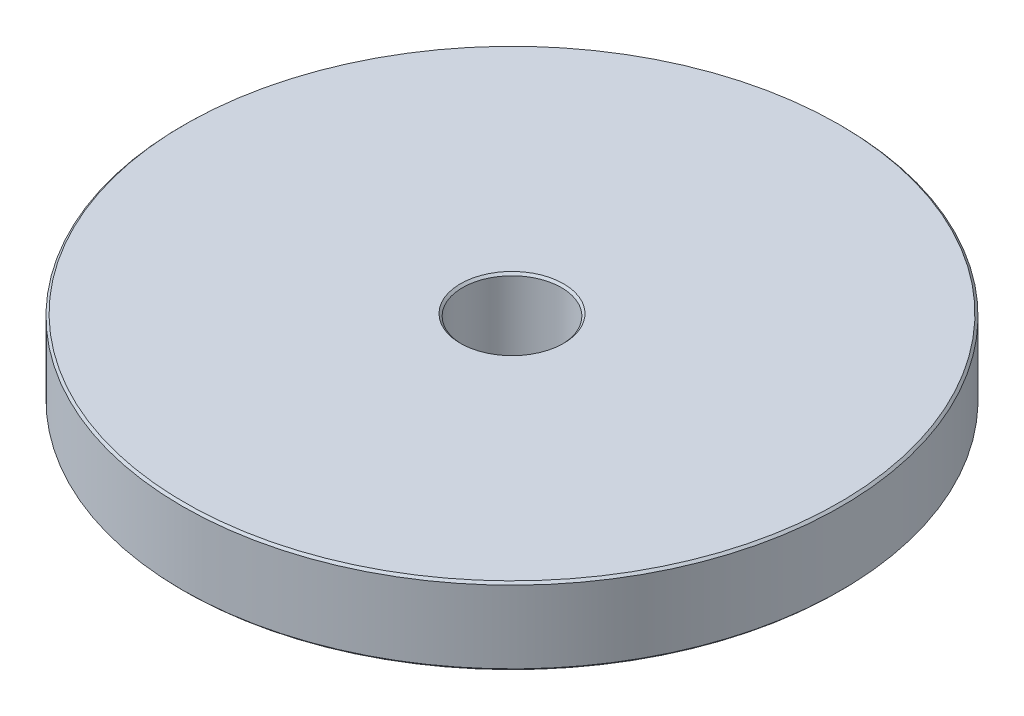
ISO-10303-21;
HEADER;
FILE_DESCRIPTION(('STEP AP214'),'2;1');
FILE_NAME('part.step','',(''),(''),'','','');
FILE_SCHEMA(('AUTOMOTIVE_DESIGN { 1 0 10303 214 1 1 1 1 }'));
ENDSEC;
DATA;
#1=APPLICATION_CONTEXT('core data for automotive mechanical design processes');
#2=APPLICATION_PROTOCOL_DEFINITION('international standard','automotive_design',2000,#1);
#3=PRODUCT_CONTEXT('',#1,'mechanical');
#4=PRODUCT('Part','Part','',(#3));
#5=PRODUCT_RELATED_PRODUCT_CATEGORY('part','',(#4));
#6=PRODUCT_DEFINITION_FORMATION('','',#4);
#7=PRODUCT_DEFINITION_CONTEXT('part definition',#1,'design');
#8=PRODUCT_DEFINITION('design','',#6,#7);
#9=PRODUCT_DEFINITION_SHAPE('','',#8);
#10=(LENGTH_UNIT() NAMED_UNIT(*) SI_UNIT(.MILLI.,.METRE.));
#11=(NAMED_UNIT(*) PLANE_ANGLE_UNIT() SI_UNIT($,.RADIAN.));
#12=(NAMED_UNIT(*) SI_UNIT($,.STERADIAN.) SOLID_ANGLE_UNIT());
#13=UNCERTAINTY_MEASURE_WITH_UNIT(LENGTH_MEASURE(1.E-05),#10,'distance_accuracy_value','');
#14=(GEOMETRIC_REPRESENTATION_CONTEXT(3) GLOBAL_UNCERTAINTY_ASSIGNED_CONTEXT((#13)) GLOBAL_UNIT_ASSIGNED_CONTEXT((#10,
#11,#12)) REPRESENTATION_CONTEXT('',''));
#15=CARTESIAN_POINT('',(0.,0.,0.));
#16=DIRECTION('',(0.,0.,1.));
#17=DIRECTION('',(1.,0.,0.));
#18=AXIS2_PLACEMENT_3D('',#15,#16,#17);
#19=CARTESIAN_POINT('',(0.,-9.3,0.));
#20=DIRECTION('',(0.,-1.,0.));
#21=DIRECTION('',(0.,0.,-1.));
#22=AXIS2_PLACEMENT_3D('',#19,#20,#21);
#23=CONICAL_SURFACE('',#22,4.5,0.785398163397448);
#24=CARTESIAN_POINT('',(0.,-9.5,0.));
#25=DIRECTION('',(0.,-1.,0.));
#26=DIRECTION('',(0.,0.,-1.));
#27=AXIS2_PLACEMENT_3D('',#24,#25,#26);
#28=CIRCLE('',#27,4.7);
#29=CARTESIAN_POINT('',(0.,-9.5,-4.7));
#30=VERTEX_POINT('',#29);
#31=EDGE_CURVE('E10',#30,#30,#28,.T.);
#32=ORIENTED_EDGE('',*,*,#31,.T.);
#33=EDGE_LOOP('',(#32));
#34=FACE_BOUND('',#33,.T.);
#35=CARTESIAN_POINT('',(0.,-9.3,0.));
#36=DIRECTION('',(0.,-1.,0.));
#37=DIRECTION('',(0.,0.,-1.));
#38=AXIS2_PLACEMENT_3D('',#35,#36,#37);
#39=CIRCLE('',#38,4.5);
#40=CARTESIAN_POINT('',(0.,-9.3,-4.5));
#41=VERTEX_POINT('',#40);
#42=EDGE_CURVE('E75',#41,#41,#39,.T.);
#43=ORIENTED_EDGE('',*,*,#42,.F.);
#44=EDGE_LOOP('',(#43));
#45=FACE_BOUND('',#44,.T.);
#46=ADVANCED_FACE('F38',(#34,#45),#23,.F.);
#47=CARTESIAN_POINT('',(4.7,-9.5,0.));
#48=DIRECTION('',(0.,-1.,0.));
#49=DIRECTION('',(0.,0.,-1.));
#50=AXIS2_PLACEMENT_3D('',#47,#48,#49);
#51=PLANE('',#50);
#52=CARTESIAN_POINT('',(0.,-9.5,0.));
#53=DIRECTION('',(0.,-1.,0.));
#54=DIRECTION('',(0.,0.,-1.));
#55=AXIS2_PLACEMENT_3D('',#52,#53,#54);
#56=CIRCLE('',#55,29.8);
#57=CARTESIAN_POINT('',(0.,-9.5,-29.8));
#58=VERTEX_POINT('',#57);
#59=EDGE_CURVE('E45',#58,#58,#56,.T.);
#60=ORIENTED_EDGE('',*,*,#59,.T.);
#61=EDGE_LOOP('',(#60));
#62=FACE_BOUND('',#61,.T.);
#63=ORIENTED_EDGE('',*,*,#31,.F.);
#64=EDGE_LOOP('',(#63));
#65=FACE_BOUND('',#64,.T.);
#66=ADVANCED_FACE('F85',(#62,#65),#51,.T.);
#67=CARTESIAN_POINT('',(0.,-9.5,0.));
#68=DIRECTION('',(0.,1.,0.));
#69=DIRECTION('',(0.,0.,1.));
#70=AXIS2_PLACEMENT_3D('',#67,#68,#69);
#71=CONICAL_SURFACE('',#70,29.8,0.785398163397448);
#72=CARTESIAN_POINT('',(0.,-9.3,0.));
#73=DIRECTION('',(0.,-1.,0.));
#74=DIRECTION('',(0.,0.,-1.));
#75=AXIS2_PLACEMENT_3D('',#72,#73,#74);
#76=CIRCLE('',#75,30.);
#77=CARTESIAN_POINT('',(0.,-9.3,-30.));
#78=VERTEX_POINT('',#77);
#79=EDGE_CURVE('E51',#78,#78,#76,.T.);
#80=ORIENTED_EDGE('',*,*,#79,.T.);
#81=EDGE_LOOP('',(#80));
#82=FACE_BOUND('',#81,.T.);
#83=ORIENTED_EDGE('',*,*,#59,.F.);
#84=EDGE_LOOP('',(#83));
#85=FACE_BOUND('',#84,.T.);
#86=ADVANCED_FACE('F89',(#82,#85),#71,.T.);
#87=CARTESIAN_POINT('',(0.,9.5,0.));
#88=DIRECTION('',(0.,-1.,0.));
#89=DIRECTION('',(0.,0.,-1.));
#90=AXIS2_PLACEMENT_3D('',#87,#88,#89);
#91=CYLINDRICAL_SURFACE('',#90,30.);
#92=CARTESIAN_POINT('',(0.,-2.7,0.));
#93=DIRECTION('',(0.,-1.,0.));
#94=DIRECTION('',(0.,0.,-1.));
#95=AXIS2_PLACEMENT_3D('',#92,#93,#94);
#96=CIRCLE('',#95,30.);
#97=CARTESIAN_POINT('',(0.,-2.7,-30.));
#98=VERTEX_POINT('',#97);
#99=EDGE_CURVE('E57',#98,#98,#96,.T.);
#100=ORIENTED_EDGE('',*,*,#99,.T.);
#101=EDGE_LOOP('',(#100));
#102=FACE_BOUND('',#101,.T.);
#103=ORIENTED_EDGE('',*,*,#79,.F.);
#104=EDGE_LOOP('',(#103));
#105=FACE_BOUND('',#104,.T.);
#106=ADVANCED_FACE('F93',(#102,#105),#91,.T.);
#107=CARTESIAN_POINT('',(0.,-2.7,0.));
#108=DIRECTION('',(0.,-1.,0.));
#109=DIRECTION('',(0.,0.,-1.));
#110=AXIS2_PLACEMENT_3D('',#107,#108,#109);
#111=CONICAL_SURFACE('',#110,30.,0.785398163397448);
#112=CARTESIAN_POINT('',(0.,-2.5,0.));
#113=DIRECTION('',(0.,-1.,0.));
#114=DIRECTION('',(0.,0.,-1.));
#115=AXIS2_PLACEMENT_3D('',#112,#113,#114);
#116=CIRCLE('',#115,29.8);
#117=CARTESIAN_POINT('',(0.,-2.5,-29.8));
#118=VERTEX_POINT('',#117);
#119=EDGE_CURVE('E63',#118,#118,#116,.T.);
#120=ORIENTED_EDGE('',*,*,#119,.T.);
#121=EDGE_LOOP('',(#120));
#122=FACE_BOUND('',#121,.T.);
#123=ORIENTED_EDGE('',*,*,#99,.F.);
#124=EDGE_LOOP('',(#123));
#125=FACE_BOUND('',#124,.T.);
#126=ADVANCED_FACE('F100',(#122,#125),#111,.T.);
#127=CARTESIAN_POINT('',(4.7,-2.5,0.));
#128=DIRECTION('',(0.,1.,0.));
#129=DIRECTION('',(0.,0.,1.));
#130=AXIS2_PLACEMENT_3D('',#127,#128,#129);
#131=PLANE('',#130);
#132=CARTESIAN_POINT('',(0.,-2.5,0.));
#133=DIRECTION('',(0.,-1.,0.));
#134=DIRECTION('',(0.,0.,-1.));
#135=AXIS2_PLACEMENT_3D('',#132,#133,#134);
#136=CIRCLE('',#135,4.7);
#137=CARTESIAN_POINT('',(0.,-2.5,-4.7));
#138=VERTEX_POINT('',#137);
#139=EDGE_CURVE('E67',#138,#138,#136,.T.);
#140=ORIENTED_EDGE('',*,*,#139,.T.);
#141=EDGE_LOOP('',(#140));
#142=FACE_BOUND('',#141,.T.);
#143=ORIENTED_EDGE('',*,*,#119,.F.);
#144=EDGE_LOOP('',(#143));
#145=FACE_BOUND('',#144,.T.);
#146=ADVANCED_FACE('F104',(#142,#145),#131,.T.);
#147=CARTESIAN_POINT('',(0.,-2.5,0.));
#148=DIRECTION('',(0.,1.,0.));
#149=DIRECTION('',(0.,0.,1.));
#150=AXIS2_PLACEMENT_3D('',#147,#148,#149);
#151=CONICAL_SURFACE('',#150,4.7,0.78539816339745);
#152=CARTESIAN_POINT('',(0.,-2.7,0.));
#153=DIRECTION('',(0.,-1.,0.));
#154=DIRECTION('',(0.,0.,-1.));
#155=AXIS2_PLACEMENT_3D('',#152,#153,#154);
#156=CIRCLE('',#155,4.5);
#157=CARTESIAN_POINT('',(0.,-2.7,-4.5));
#158=VERTEX_POINT('',#157);
#159=EDGE_CURVE('E71',#158,#158,#156,.T.);
#160=ORIENTED_EDGE('',*,*,#159,.T.);
#161=EDGE_LOOP('',(#160));
#162=FACE_BOUND('',#161,.T.);
#163=ORIENTED_EDGE('',*,*,#139,.F.);
#164=EDGE_LOOP('',(#163));
#165=FACE_BOUND('',#164,.T.);
#166=ADVANCED_FACE('F108',(#162,#165),#151,.F.);
#167=CARTESIAN_POINT('',(0.,9.5,0.));
#168=DIRECTION('',(0.,-1.,0.));
#169=DIRECTION('',(0.,0.,-1.));
#170=AXIS2_PLACEMENT_3D('',#167,#168,#169);
#171=CYLINDRICAL_SURFACE('',#170,4.5);
#172=ORIENTED_EDGE('',*,*,#42,.T.);
#173=EDGE_LOOP('',(#172));
#174=FACE_BOUND('',#173,.T.);
#175=ORIENTED_EDGE('',*,*,#159,.F.);
#176=EDGE_LOOP('',(#175));
#177=FACE_BOUND('',#176,.T.);
#178=ADVANCED_FACE('F81',(#174,#177),#171,.F.);
#179=CLOSED_SHELL('',(#46,#66,#86,#106,#126,#146,#166,#178));
#180=MANIFOLD_SOLID_BREP('B2',#179);
#181=ADVANCED_BREP_SHAPE_REPRESENTATION('',(#18,#180),#14);
#182=SHAPE_DEFINITION_REPRESENTATION(#9,#181);
ENDSEC;
END-ISO-10303-21;
